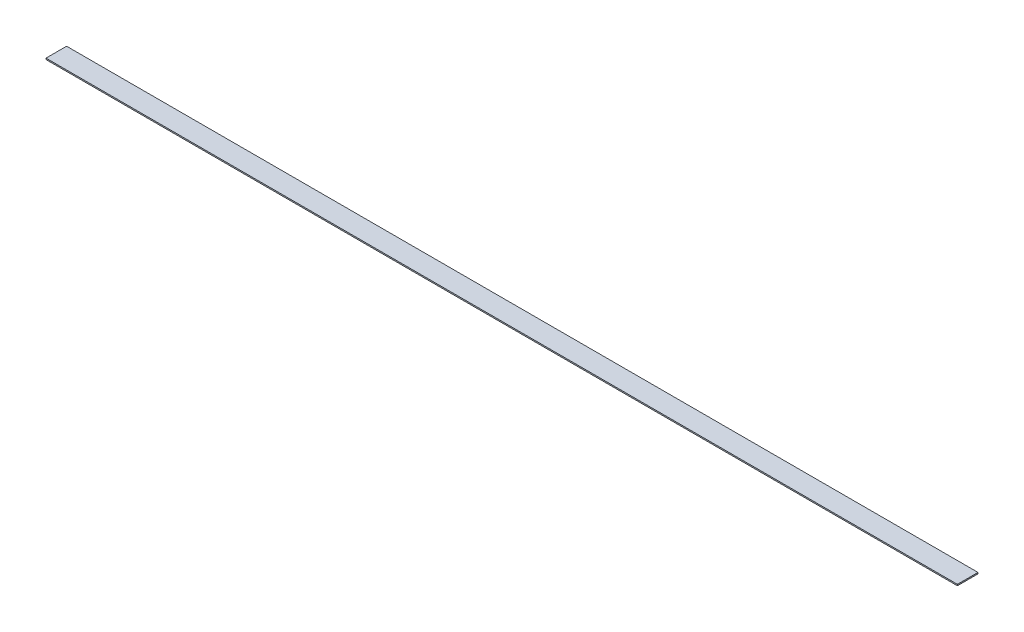
ISO-10303-21;
HEADER;
FILE_DESCRIPTION(('STEP AP214'),'2;1');
FILE_NAME('part.step','',(''),(''),'','','');
FILE_SCHEMA(('AUTOMOTIVE_DESIGN { 1 0 10303 214 1 1 1 1 }'));
ENDSEC;
DATA;
#1=APPLICATION_CONTEXT('core data for automotive mechanical design processes');
#2=APPLICATION_PROTOCOL_DEFINITION('international standard','automotive_design',2000,#1);
#3=PRODUCT_CONTEXT('',#1,'mechanical');
#4=PRODUCT('Part','Part','',(#3));
#5=PRODUCT_RELATED_PRODUCT_CATEGORY('part','',(#4));
#6=PRODUCT_DEFINITION_FORMATION('','',#4);
#7=PRODUCT_DEFINITION_CONTEXT('part definition',#1,'design');
#8=PRODUCT_DEFINITION('design','',#6,#7);
#9=PRODUCT_DEFINITION_SHAPE('','',#8);
#10=(LENGTH_UNIT() NAMED_UNIT(*) SI_UNIT(.MILLI.,.METRE.));
#11=(NAMED_UNIT(*) PLANE_ANGLE_UNIT() SI_UNIT($,.RADIAN.));
#12=(NAMED_UNIT(*) SI_UNIT($,.STERADIAN.) SOLID_ANGLE_UNIT());
#13=UNCERTAINTY_MEASURE_WITH_UNIT(LENGTH_MEASURE(1.E-05),#10,'distance_accuracy_value','');
#14=(GEOMETRIC_REPRESENTATION_CONTEXT(3) GLOBAL_UNCERTAINTY_ASSIGNED_CONTEXT((#13)) GLOBAL_UNIT_ASSIGNED_CONTEXT((#10,
#11,#12)) REPRESENTATION_CONTEXT('',''));
#15=CARTESIAN_POINT('',(0.,0.,0.));
#16=DIRECTION('',(0.,0.,1.));
#17=DIRECTION('',(1.,0.,0.));
#18=AXIS2_PLACEMENT_3D('',#15,#16,#17);
#19=CARTESIAN_POINT('',(0.,3.175,0.));
#20=DIRECTION('',(1.,0.,0.));
#21=DIRECTION('',(0.,0.,-1.));
#22=AXIS2_PLACEMENT_3D('',#19,#20,#21);
#23=PLANE('',#22);
#24=DIRECTION('',(0.,0.,1.));
#25=VECTOR('',#24,1.);
#26=CARTESIAN_POINT('',(0.,0.,0.));
#27=LINE('',#26,#25);
#28=CARTESIAN_POINT('',(0.,0.,-50.8));
#29=VERTEX_POINT('',#28);
#30=CARTESIAN_POINT('',(0.,0.,0.));
#31=VERTEX_POINT('',#30);
#32=EDGE_CURVE('E95',#29,#31,#27,.T.);
#33=ORIENTED_EDGE('',*,*,#32,.T.);
#34=DIRECTION('',(0.,-1.,0.));
#35=VECTOR('',#34,1.);
#36=CARTESIAN_POINT('',(0.,3.175,0.));
#37=LINE('',#36,#35);
#38=CARTESIAN_POINT('',(0.,3.175,0.));
#39=VERTEX_POINT('',#38);
#40=EDGE_CURVE('E11',#39,#31,#37,.T.);
#41=ORIENTED_EDGE('',*,*,#40,.F.);
#42=DIRECTION('',(0.,0.,1.));
#43=VECTOR('',#42,1.);
#44=CARTESIAN_POINT('',(0.,3.175,0.));
#45=LINE('',#44,#43);
#46=CARTESIAN_POINT('',(0.,3.175,-50.8));
#47=VERTEX_POINT('',#46);
#48=EDGE_CURVE('E83',#47,#39,#45,.T.);
#49=ORIENTED_EDGE('',*,*,#48,.F.);
#50=DIRECTION('',(0.,-1.,0.));
#51=VECTOR('',#50,1.);
#52=CARTESIAN_POINT('',(0.,3.175,-50.8));
#53=LINE('',#52,#51);
#54=EDGE_CURVE('E91',#47,#29,#53,.T.);
#55=ORIENTED_EDGE('',*,*,#54,.T.);
#56=EDGE_LOOP('',(#33,#41,#49,#55));
#57=FACE_BOUND('',#56,.T.);
#58=ADVANCED_FACE('F32',(#57),#23,.F.);
#59=CARTESIAN_POINT('',(0.,3.175,0.));
#60=DIRECTION('',(0.,0.,-1.));
#61=DIRECTION('',(-1.,0.,0.));
#62=AXIS2_PLACEMENT_3D('',#59,#60,#61);
#63=PLANE('',#62);
#64=DIRECTION('',(1.,0.,0.));
#65=VECTOR('',#64,1.);
#66=CARTESIAN_POINT('',(0.,0.,0.));
#67=LINE('',#66,#65);
#68=CARTESIAN_POINT('',(2247.9,0.,0.));
#69=VERTEX_POINT('',#68);
#70=EDGE_CURVE('E87',#31,#69,#67,.T.);
#71=ORIENTED_EDGE('',*,*,#70,.T.);
#72=DIRECTION('',(0.,-1.,0.));
#73=VECTOR('',#72,1.);
#74=CARTESIAN_POINT('',(2247.9,3.175,0.));
#75=LINE('',#74,#73);
#76=CARTESIAN_POINT('',(2247.9,3.175,0.));
#77=VERTEX_POINT('',#76);
#78=EDGE_CURVE('E40',#77,#69,#75,.T.);
#79=ORIENTED_EDGE('',*,*,#78,.F.);
#80=DIRECTION('',(1.,0.,0.));
#81=VECTOR('',#80,1.);
#82=CARTESIAN_POINT('',(0.,3.175,0.));
#83=LINE('',#82,#81);
#84=EDGE_CURVE('E78',#39,#77,#83,.T.);
#85=ORIENTED_EDGE('',*,*,#84,.F.);
#86=ORIENTED_EDGE('',*,*,#40,.T.);
#87=EDGE_LOOP('',(#71,#79,#85,#86));
#88=FACE_BOUND('',#87,.T.);
#89=ADVANCED_FACE('F86',(#88),#63,.F.);
#90=CARTESIAN_POINT('',(2247.9,3.175,0.));
#91=DIRECTION('',(-1.,0.,0.));
#92=DIRECTION('',(0.,0.,1.));
#93=AXIS2_PLACEMENT_3D('',#90,#91,#92);
#94=PLANE('',#93);
#95=DIRECTION('',(0.,0.,-1.));
#96=VECTOR('',#95,1.);
#97=CARTESIAN_POINT('',(2247.9,0.,0.));
#98=LINE('',#97,#96);
#99=CARTESIAN_POINT('',(2247.9,0.,-50.8));
#100=VERTEX_POINT('',#99);
#101=EDGE_CURVE('E65',#69,#100,#98,.T.);
#102=ORIENTED_EDGE('',*,*,#101,.T.);
#103=DIRECTION('',(0.,-1.,0.));
#104=VECTOR('',#103,1.);
#105=CARTESIAN_POINT('',(2247.9,3.175,-50.8));
#106=LINE('',#105,#104);
#107=CARTESIAN_POINT('',(2247.9,3.175,-50.8));
#108=VERTEX_POINT('',#107);
#109=EDGE_CURVE('E88',#108,#100,#106,.T.);
#110=ORIENTED_EDGE('',*,*,#109,.F.);
#111=DIRECTION('',(0.,0.,-1.));
#112=VECTOR('',#111,1.);
#113=CARTESIAN_POINT('',(2247.9,3.175,0.));
#114=LINE('',#113,#112);
#115=EDGE_CURVE('E81',#77,#108,#114,.T.);
#116=ORIENTED_EDGE('',*,*,#115,.F.);
#117=ORIENTED_EDGE('',*,*,#78,.T.);
#118=EDGE_LOOP('',(#102,#110,#116,#117));
#119=FACE_BOUND('',#118,.T.);
#120=ADVANCED_FACE('F89',(#119),#94,.F.);
#121=CARTESIAN_POINT('',(0.,3.175,-50.8));
#122=DIRECTION('',(0.,0.,1.));
#123=DIRECTION('',(1.,0.,0.));
#124=AXIS2_PLACEMENT_3D('',#121,#122,#123);
#125=PLANE('',#124);
#126=DIRECTION('',(-1.,0.,0.));
#127=VECTOR('',#126,1.);
#128=CARTESIAN_POINT('',(0.,0.,-50.8));
#129=LINE('',#128,#127);
#130=EDGE_CURVE('E71',#100,#29,#129,.T.);
#131=ORIENTED_EDGE('',*,*,#130,.T.);
#132=ORIENTED_EDGE('',*,*,#54,.F.);
#133=DIRECTION('',(-1.,0.,0.));
#134=VECTOR('',#133,1.);
#135=CARTESIAN_POINT('',(0.,3.175,-50.8));
#136=LINE('',#135,#134);
#137=EDGE_CURVE('E48',#108,#47,#136,.T.);
#138=ORIENTED_EDGE('',*,*,#137,.F.);
#139=ORIENTED_EDGE('',*,*,#109,.T.);
#140=EDGE_LOOP('',(#131,#132,#138,#139));
#141=FACE_BOUND('',#140,.T.);
#142=ADVANCED_FACE('F102',(#141),#125,.F.);
#143=CARTESIAN_POINT('',(0.,3.175,0.));
#144=DIRECTION('',(0.,-1.,0.));
#145=DIRECTION('',(0.,0.,-1.));
#146=AXIS2_PLACEMENT_3D('',#143,#144,#145);
#147=PLANE('',#146);
#148=ORIENTED_EDGE('',*,*,#48,.T.);
#149=ORIENTED_EDGE('',*,*,#84,.T.);
#150=ORIENTED_EDGE('',*,*,#115,.T.);
#151=ORIENTED_EDGE('',*,*,#137,.T.);
#152=EDGE_LOOP('',(#148,#149,#150,#151));
#153=FACE_BOUND('',#152,.T.);
#154=ADVANCED_FACE('F79',(#153),#147,.F.);
#155=CARTESIAN_POINT('',(0.,0.,0.));
#156=DIRECTION('',(0.,-1.,0.));
#157=DIRECTION('',(0.,0.,-1.));
#158=AXIS2_PLACEMENT_3D('',#155,#156,#157);
#159=PLANE('',#158);
#160=ORIENTED_EDGE('',*,*,#32,.F.);
#161=ORIENTED_EDGE('',*,*,#130,.F.);
#162=ORIENTED_EDGE('',*,*,#101,.F.);
#163=ORIENTED_EDGE('',*,*,#70,.F.);
#164=EDGE_LOOP('',(#160,#161,#162,#163));
#165=FACE_BOUND('',#164,.T.);
#166=ADVANCED_FACE('F105',(#165),#159,.T.);
#167=CLOSED_SHELL('',(#58,#89,#120,#142,#154,#166));
#168=MANIFOLD_SOLID_BREP('B2',#167);
#169=ADVANCED_BREP_SHAPE_REPRESENTATION('',(#18,#168),#14);
#170=SHAPE_DEFINITION_REPRESENTATION(#9,#169);
ENDSEC;
END-ISO-10303-21;
